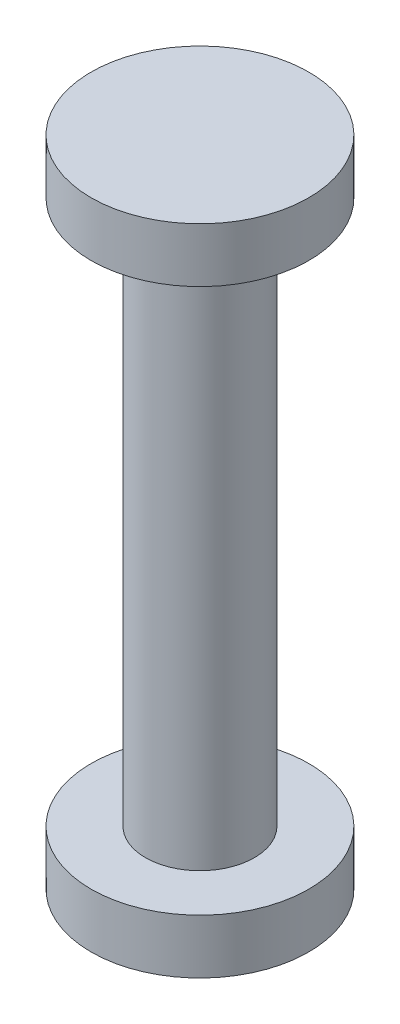
ISO-10303-21;
HEADER;
FILE_DESCRIPTION(('STEP AP214'),'2;1');
FILE_NAME('part.step','',(''),(''),'','','');
FILE_SCHEMA(('AUTOMOTIVE_DESIGN { 1 0 10303 214 1 1 1 1 }'));
ENDSEC;
DATA;
#1=APPLICATION_CONTEXT('core data for automotive mechanical design processes');
#2=APPLICATION_PROTOCOL_DEFINITION('international standard','automotive_design',2000,#1);
#3=PRODUCT_CONTEXT('',#1,'mechanical');
#4=PRODUCT('Part','Part','',(#3));
#5=PRODUCT_RELATED_PRODUCT_CATEGORY('part','',(#4));
#6=PRODUCT_DEFINITION_FORMATION('','',#4);
#7=PRODUCT_DEFINITION_CONTEXT('part definition',#1,'design');
#8=PRODUCT_DEFINITION('design','',#6,#7);
#9=PRODUCT_DEFINITION_SHAPE('','',#8);
#10=(LENGTH_UNIT() NAMED_UNIT(*) SI_UNIT(.MILLI.,.METRE.));
#11=(NAMED_UNIT(*) PLANE_ANGLE_UNIT() SI_UNIT($,.RADIAN.));
#12=(NAMED_UNIT(*) SI_UNIT($,.STERADIAN.) SOLID_ANGLE_UNIT());
#13=UNCERTAINTY_MEASURE_WITH_UNIT(LENGTH_MEASURE(1.E-05),#10,'distance_accuracy_value','');
#14=(GEOMETRIC_REPRESENTATION_CONTEXT(3) GLOBAL_UNCERTAINTY_ASSIGNED_CONTEXT((#13)) GLOBAL_UNIT_ASSIGNED_CONTEXT((#10,
#11,#12)) REPRESENTATION_CONTEXT('',''));
#15=CARTESIAN_POINT('',(0.,0.,0.));
#16=DIRECTION('',(0.,0.,1.));
#17=DIRECTION('',(1.,0.,0.));
#18=AXIS2_PLACEMENT_3D('',#15,#16,#17);
#19=CARTESIAN_POINT('',(0.,25.,0.));
#20=DIRECTION('',(0.,-1.,0.));
#21=DIRECTION('',(0.,0.,-1.));
#22=AXIS2_PLACEMENT_3D('',#19,#20,#21);
#23=CYLINDRICAL_SURFACE('',#22,5.);
#24=CARTESIAN_POINT('',(0.,25.,0.));
#25=DIRECTION('',(0.,1.,0.));
#26=DIRECTION('',(0.,0.,1.));
#27=AXIS2_PLACEMENT_3D('',#24,#25,#26);
#28=CIRCLE('',#27,5.);
#29=CARTESIAN_POINT('',(0.,25.,5.));
#30=VERTEX_POINT('',#29);
#31=EDGE_CURVE('E10',#30,#30,#28,.T.);
#32=ORIENTED_EDGE('',*,*,#31,.F.);
#33=EDGE_LOOP('',(#32));
#34=FACE_BOUND('',#33,.T.);
#35=CARTESIAN_POINT('',(0.,-25.,0.));
#36=DIRECTION('',(0.,1.,0.));
#37=DIRECTION('',(0.,0.,1.));
#38=AXIS2_PLACEMENT_3D('',#35,#36,#37);
#39=CIRCLE('',#38,5.);
#40=CARTESIAN_POINT('',(0.,-25.,5.));
#41=VERTEX_POINT('',#40);
#42=EDGE_CURVE('E40',#41,#41,#39,.T.);
#43=ORIENTED_EDGE('',*,*,#42,.T.);
#44=EDGE_LOOP('',(#43));
#45=FACE_BOUND('',#44,.T.);
#46=ADVANCED_FACE('F37',(#34,#45),#23,.T.);
#47=CARTESIAN_POINT('',(0.,30.,0.));
#48=DIRECTION('',(0.,-1.,0.));
#49=DIRECTION('',(0.,0.,-1.));
#50=AXIS2_PLACEMENT_3D('',#47,#48,#49);
#51=CYLINDRICAL_SURFACE('',#50,10.);
#52=CARTESIAN_POINT('',(0.,30.,0.));
#53=DIRECTION('',(0.,1.,0.));
#54=DIRECTION('',(0.,0.,1.));
#55=AXIS2_PLACEMENT_3D('',#52,#53,#54);
#56=CIRCLE('',#55,10.);
#57=CARTESIAN_POINT('',(0.,30.,10.));
#58=VERTEX_POINT('',#57);
#59=EDGE_CURVE('E45',#58,#58,#56,.T.);
#60=ORIENTED_EDGE('',*,*,#59,.F.);
#61=EDGE_LOOP('',(#60));
#62=FACE_BOUND('',#61,.T.);
#63=CARTESIAN_POINT('',(0.,25.,0.));
#64=DIRECTION('',(0.,1.,0.));
#65=DIRECTION('',(0.,0.,1.));
#66=AXIS2_PLACEMENT_3D('',#63,#64,#65);
#67=CIRCLE('',#66,10.);
#68=CARTESIAN_POINT('',(0.,25.,10.));
#69=VERTEX_POINT('',#68);
#70=EDGE_CURVE('E50',#69,#69,#67,.T.);
#71=ORIENTED_EDGE('',*,*,#70,.T.);
#72=EDGE_LOOP('',(#71));
#73=FACE_BOUND('',#72,.T.);
#74=ADVANCED_FACE('F91',(#62,#73),#51,.T.);
#75=CARTESIAN_POINT('',(0.,30.,0.));
#76=DIRECTION('',(0.,1.,0.));
#77=DIRECTION('',(0.,0.,1.));
#78=AXIS2_PLACEMENT_3D('',#75,#76,#77);
#79=PLANE('',#78);
#80=ORIENTED_EDGE('',*,*,#59,.T.);
#81=EDGE_LOOP('',(#80));
#82=FACE_BOUND('',#81,.T.);
#83=ADVANCED_FACE('F87',(#82),#79,.T.);
#84=CARTESIAN_POINT('',(0.,25.,0.));
#85=DIRECTION('',(0.,1.,0.));
#86=DIRECTION('',(0.,0.,1.));
#87=AXIS2_PLACEMENT_3D('',#84,#85,#86);
#88=PLANE('',#87);
#89=ORIENTED_EDGE('',*,*,#31,.T.);
#90=EDGE_LOOP('',(#89));
#91=FACE_BOUND('',#90,.T.);
#92=ORIENTED_EDGE('',*,*,#70,.F.);
#93=EDGE_LOOP('',(#92));
#94=FACE_BOUND('',#93,.T.);
#95=ADVANCED_FACE('F79',(#91,#94),#88,.F.);
#96=CARTESIAN_POINT('',(0.,-30.,0.));
#97=DIRECTION('',(0.,1.,0.));
#98=DIRECTION('',(0.,0.,1.));
#99=AXIS2_PLACEMENT_3D('',#96,#97,#98);
#100=CYLINDRICAL_SURFACE('',#99,10.);
#101=CARTESIAN_POINT('',(0.,-30.,0.));
#102=DIRECTION('',(0.,1.,0.));
#103=DIRECTION('',(0.,0.,1.));
#104=AXIS2_PLACEMENT_3D('',#101,#102,#103);
#105=CIRCLE('',#104,10.);
#106=CARTESIAN_POINT('',(0.,-30.,10.));
#107=VERTEX_POINT('',#106);
#108=EDGE_CURVE('E60',#107,#107,#105,.T.);
#109=ORIENTED_EDGE('',*,*,#108,.T.);
#110=EDGE_LOOP('',(#109));
#111=FACE_BOUND('',#110,.T.);
#112=CARTESIAN_POINT('',(0.,-25.,0.));
#113=DIRECTION('',(0.,1.,0.));
#114=DIRECTION('',(0.,0.,1.));
#115=AXIS2_PLACEMENT_3D('',#112,#113,#114);
#116=CIRCLE('',#115,10.);
#117=CARTESIAN_POINT('',(0.,-25.,10.));
#118=VERTEX_POINT('',#117);
#119=EDGE_CURVE('E56',#118,#118,#116,.T.);
#120=ORIENTED_EDGE('',*,*,#119,.F.);
#121=EDGE_LOOP('',(#120));
#122=FACE_BOUND('',#121,.T.);
#123=ADVANCED_FACE('F77',(#111,#122),#100,.T.);
#124=CARTESIAN_POINT('',(0.,-30.,0.));
#125=DIRECTION('',(0.,-1.,0.));
#126=DIRECTION('',(0.,0.,1.));
#127=AXIS2_PLACEMENT_3D('',#124,#125,#126);
#128=PLANE('',#127);
#129=ORIENTED_EDGE('',*,*,#108,.F.);
#130=EDGE_LOOP('',(#129));
#131=FACE_BOUND('',#130,.T.);
#132=ADVANCED_FACE('F73',(#131),#128,.T.);
#133=CARTESIAN_POINT('',(0.,-25.,0.));
#134=DIRECTION('',(0.,-1.,0.));
#135=DIRECTION('',(0.,0.,1.));
#136=AXIS2_PLACEMENT_3D('',#133,#134,#135);
#137=PLANE('',#136);
#138=ORIENTED_EDGE('',*,*,#42,.F.);
#139=EDGE_LOOP('',(#138));
#140=FACE_BOUND('',#139,.T.);
#141=ORIENTED_EDGE('',*,*,#119,.T.);
#142=EDGE_LOOP('',(#141));
#143=FACE_BOUND('',#142,.T.);
#144=ADVANCED_FACE('F70',(#140,#143),#137,.F.);
#145=CLOSED_SHELL('',(#46,#74,#83,#95,#123,#132,#144));
#146=MANIFOLD_SOLID_BREP('B2',#145);
#147=ADVANCED_BREP_SHAPE_REPRESENTATION('',(#18,#146),#14);
#148=SHAPE_DEFINITION_REPRESENTATION(#9,#147);
ENDSEC;
END-ISO-10303-21;
